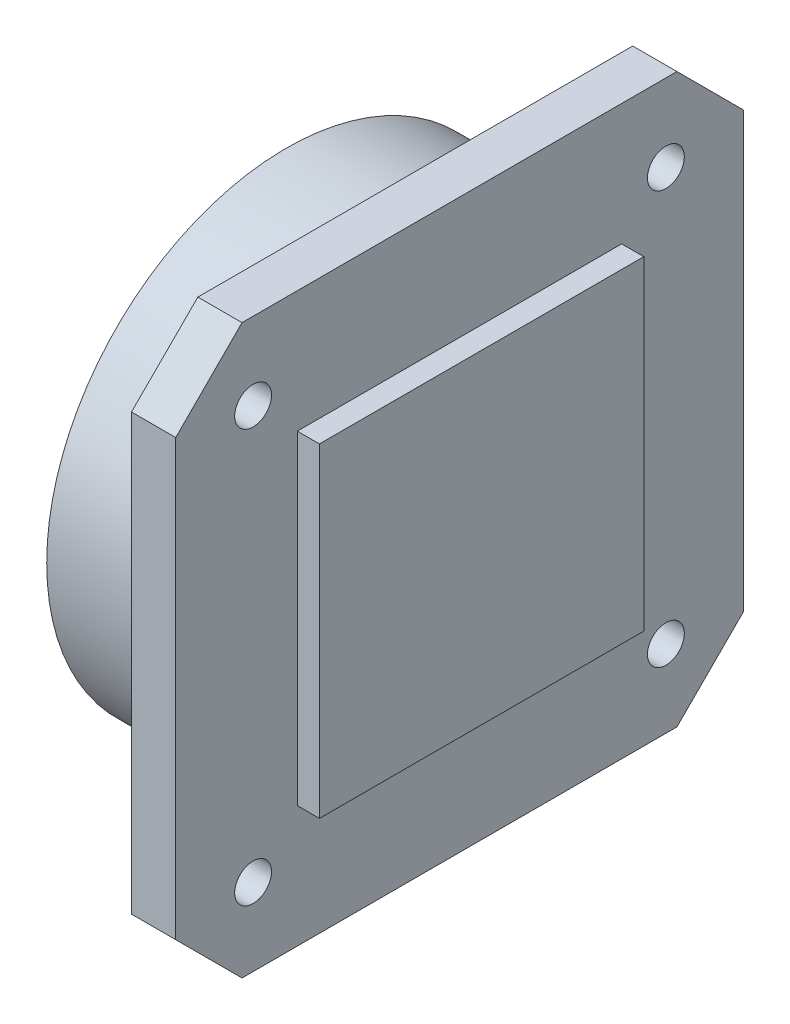
ISO-10303-21;
HEADER;
FILE_DESCRIPTION(('STEP AP214'),'2;1');
FILE_NAME('part.step','',(''),(''),'','','');
FILE_SCHEMA(('AUTOMOTIVE_DESIGN { 1 0 10303 214 1 1 1 1 }'));
ENDSEC;
DATA;
#1=APPLICATION_CONTEXT('core data for automotive mechanical design processes');
#2=APPLICATION_PROTOCOL_DEFINITION('international standard','automotive_design',2000,#1);
#3=PRODUCT_CONTEXT('',#1,'mechanical');
#4=PRODUCT('Part','Part','',(#3));
#5=PRODUCT_RELATED_PRODUCT_CATEGORY('part','',(#4));
#6=PRODUCT_DEFINITION_FORMATION('','',#4);
#7=PRODUCT_DEFINITION_CONTEXT('part definition',#1,'design');
#8=PRODUCT_DEFINITION('design','',#6,#7);
#9=PRODUCT_DEFINITION_SHAPE('','',#8);
#10=(LENGTH_UNIT() NAMED_UNIT(*) SI_UNIT(.MILLI.,.METRE.));
#11=(NAMED_UNIT(*) PLANE_ANGLE_UNIT() SI_UNIT($,.RADIAN.));
#12=(NAMED_UNIT(*) SI_UNIT($,.STERADIAN.) SOLID_ANGLE_UNIT());
#13=UNCERTAINTY_MEASURE_WITH_UNIT(LENGTH_MEASURE(1.E-05),#10,'distance_accuracy_value','');
#14=(GEOMETRIC_REPRESENTATION_CONTEXT(3) GLOBAL_UNCERTAINTY_ASSIGNED_CONTEXT((#13)) GLOBAL_UNIT_ASSIGNED_CONTEXT((#10,
#11,#12)) REPRESENTATION_CONTEXT('',''));
#15=CARTESIAN_POINT('',(0.,0.,0.));
#16=DIRECTION('',(0.,0.,1.));
#17=DIRECTION('',(1.,0.,0.));
#18=AXIS2_PLACEMENT_3D('',#15,#16,#17);
#19=CARTESIAN_POINT('',(0.,77.,0.));
#20=DIRECTION('',(-1.,0.,0.));
#21=DIRECTION('',(0.,0.,1.));
#22=AXIS2_PLACEMENT_3D('',#19,#20,#21);
#23=PLANE('',#22);
#24=CARTESIAN_POINT('',(0.,10.5,-66.5));
#25=DIRECTION('',(-1.,0.,0.));
#26=DIRECTION('',(0.,0.,1.));
#27=AXIS2_PLACEMENT_3D('',#24,#25,#26);
#28=CIRCLE('',#27,2.5);
#29=CARTESIAN_POINT('',(0.,10.5,-64.));
#30=VERTEX_POINT('',#29);
#31=EDGE_CURVE('E327',#30,#30,#28,.T.);
#32=ORIENTED_EDGE('',*,*,#31,.F.);
#33=EDGE_LOOP('',(#32));
#34=FACE_BOUND('',#33,.T.);
#35=CARTESIAN_POINT('',(0.,10.5,-10.5));
#36=DIRECTION('',(-1.,0.,0.));
#37=DIRECTION('',(0.,0.,1.));
#38=AXIS2_PLACEMENT_3D('',#35,#36,#37);
#39=CIRCLE('',#38,2.5);
#40=CARTESIAN_POINT('',(0.,10.5,-8.));
#41=VERTEX_POINT('',#40);
#42=EDGE_CURVE('E337',#41,#41,#39,.T.);
#43=ORIENTED_EDGE('',*,*,#42,.F.);
#44=EDGE_LOOP('',(#43));
#45=FACE_BOUND('',#44,.T.);
#46=CARTESIAN_POINT('',(0.,66.5,-66.5));
#47=DIRECTION('',(-1.,0.,0.));
#48=DIRECTION('',(0.,0.,1.));
#49=AXIS2_PLACEMENT_3D('',#46,#47,#48);
#50=CIRCLE('',#49,2.5);
#51=CARTESIAN_POINT('',(0.,66.5,-64.));
#52=VERTEX_POINT('',#51);
#53=EDGE_CURVE('E343',#52,#52,#50,.T.);
#54=ORIENTED_EDGE('',*,*,#53,.F.);
#55=EDGE_LOOP('',(#54));
#56=FACE_BOUND('',#55,.T.);
#57=CARTESIAN_POINT('',(0.,66.5,-10.5));
#58=DIRECTION('',(-1.,0.,0.));
#59=DIRECTION('',(0.,0.,1.));
#60=AXIS2_PLACEMENT_3D('',#57,#58,#59);
#61=CIRCLE('',#60,2.5);
#62=CARTESIAN_POINT('',(0.,66.5,-8.));
#63=VERTEX_POINT('',#62);
#64=EDGE_CURVE('E349',#63,#63,#61,.T.);
#65=ORIENTED_EDGE('',*,*,#64,.F.);
#66=EDGE_LOOP('',(#65));
#67=FACE_BOUND('',#66,.T.);
#68=DIRECTION('',(0.,-1.,0.));
#69=VECTOR('',#68,1.);
#70=CARTESIAN_POINT('',(0.,9.,0.));
#71=LINE('',#70,#69);
#72=CARTESIAN_POINT('',(0.,68.,0.));
#73=VERTEX_POINT('',#72);
#74=CARTESIAN_POINT('',(0.,9.,0.));
#75=VERTEX_POINT('',#74);
#76=EDGE_CURVE('E142',#73,#75,#71,.T.);
#77=ORIENTED_EDGE('',*,*,#76,.F.);
#78=DIRECTION('',(0.,-0.707106781186547,0.707106781186548));
#79=VECTOR('',#78,1.);
#80=CARTESIAN_POINT('',(0.,68.,0.));
#81=LINE('',#80,#79);
#82=CARTESIAN_POINT('',(0.,77.,-9.));
#83=VERTEX_POINT('',#82);
#84=EDGE_CURVE('E155',#83,#73,#81,.T.);
#85=ORIENTED_EDGE('',*,*,#84,.F.);
#86=DIRECTION('',(0.,0.,1.));
#87=VECTOR('',#86,1.);
#88=CARTESIAN_POINT('',(0.,77.,-9.));
#89=LINE('',#88,#87);
#90=CARTESIAN_POINT('',(0.,77.,-68.));
#91=VERTEX_POINT('',#90);
#92=EDGE_CURVE('E179',#91,#83,#89,.T.);
#93=ORIENTED_EDGE('',*,*,#92,.F.);
#94=DIRECTION('',(0.,0.707106781186548,0.707106781186548));
#95=VECTOR('',#94,1.);
#96=CARTESIAN_POINT('',(0.,77.,-68.));
#97=LINE('',#96,#95);
#98=CARTESIAN_POINT('',(0.,68.,-77.));
#99=VERTEX_POINT('',#98);
#100=EDGE_CURVE('E177',#99,#91,#97,.T.);
#101=ORIENTED_EDGE('',*,*,#100,.F.);
#102=DIRECTION('',(0.,1.,0.));
#103=VECTOR('',#102,1.);
#104=CARTESIAN_POINT('',(0.,9.,-77.));
#105=LINE('',#104,#103);
#106=CARTESIAN_POINT('',(0.,9.,-77.));
#107=VERTEX_POINT('',#106);
#108=EDGE_CURVE('E175',#107,#99,#105,.T.);
#109=ORIENTED_EDGE('',*,*,#108,.F.);
#110=DIRECTION('',(0.,0.707106781186548,-0.707106781186547));
#111=VECTOR('',#110,1.);
#112=CARTESIAN_POINT('',(0.,0.,-68.));
#113=LINE('',#112,#111);
#114=CARTESIAN_POINT('',(0.,0.,-68.));
#115=VERTEX_POINT('',#114);
#116=EDGE_CURVE('E173',#115,#107,#113,.T.);
#117=ORIENTED_EDGE('',*,*,#116,.F.);
#118=DIRECTION('',(0.,0.,-1.));
#119=VECTOR('',#118,1.);
#120=CARTESIAN_POINT('',(0.,0.,-9.));
#121=LINE('',#120,#119);
#122=CARTESIAN_POINT('',(0.,0.,-9.));
#123=VERTEX_POINT('',#122);
#124=EDGE_CURVE('E171',#123,#115,#121,.T.);
#125=ORIENTED_EDGE('',*,*,#124,.F.);
#126=DIRECTION('',(0.,-0.707106781186547,-0.707106781186547));
#127=VECTOR('',#126,1.);
#128=CARTESIAN_POINT('',(0.,9.,0.));
#129=LINE('',#128,#127);
#130=EDGE_CURVE('E145',#75,#123,#129,.T.);
#131=ORIENTED_EDGE('',*,*,#130,.F.);
#132=EDGE_LOOP('',(#77,#85,#93,#101,#109,#117,#125,#131));
#133=FACE_BOUND('',#132,.T.);
#134=CARTESIAN_POINT('',(0.,38.5,-38.5));
#135=DIRECTION('',(-1.,0.,0.));
#136=DIRECTION('',(0.,0.,1.));
#137=AXIS2_PLACEMENT_3D('',#134,#135,#136);
#138=CIRCLE('',#137,32.5);
#139=CARTESIAN_POINT('',(0.,38.5,-6.00000000000001));
#140=VERTEX_POINT('',#139);
#141=EDGE_CURVE('E358',#140,#140,#138,.T.);
#142=ORIENTED_EDGE('',*,*,#141,.F.);
#143=EDGE_LOOP('',(#142));
#144=FACE_BOUND('',#143,.T.);
#145=ADVANCED_FACE('F32',(#34,#45,#56,#67,#133,#144),#23,.T.);
#146=CARTESIAN_POINT('',(6.,77.,0.));
#147=DIRECTION('',(-1.,0.,0.));
#148=DIRECTION('',(0.,0.,1.));
#149=AXIS2_PLACEMENT_3D('',#146,#147,#148);
#150=PLANE('',#149);
#151=CARTESIAN_POINT('',(6.,10.5,-66.5));
#152=DIRECTION('',(1.,0.,0.));
#153=DIRECTION('',(0.,0.,-1.));
#154=AXIS2_PLACEMENT_3D('',#151,#152,#153);
#155=CIRCLE('',#154,2.5);
#156=CARTESIAN_POINT('',(6.,10.5,-69.));
#157=VERTEX_POINT('',#156);
#158=EDGE_CURVE('E323',#157,#157,#155,.T.);
#159=ORIENTED_EDGE('',*,*,#158,.F.);
#160=EDGE_LOOP('',(#159));
#161=FACE_BOUND('',#160,.T.);
#162=CARTESIAN_POINT('',(6.,10.5,-10.5));
#163=DIRECTION('',(1.,0.,0.));
#164=DIRECTION('',(0.,0.,-1.));
#165=AXIS2_PLACEMENT_3D('',#162,#163,#164);
#166=CIRCLE('',#165,2.5);
#167=CARTESIAN_POINT('',(6.,10.5,-13.));
#168=VERTEX_POINT('',#167);
#169=EDGE_CURVE('E334',#168,#168,#166,.T.);
#170=ORIENTED_EDGE('',*,*,#169,.F.);
#171=EDGE_LOOP('',(#170));
#172=FACE_BOUND('',#171,.T.);
#173=CARTESIAN_POINT('',(6.,66.5,-66.5));
#174=DIRECTION('',(1.,0.,0.));
#175=DIRECTION('',(0.,0.,-1.));
#176=AXIS2_PLACEMENT_3D('',#173,#174,#175);
#177=CIRCLE('',#176,2.5);
#178=CARTESIAN_POINT('',(6.,66.5,-69.));
#179=VERTEX_POINT('',#178);
#180=EDGE_CURVE('E340',#179,#179,#177,.T.);
#181=ORIENTED_EDGE('',*,*,#180,.F.);
#182=EDGE_LOOP('',(#181));
#183=FACE_BOUND('',#182,.T.);
#184=CARTESIAN_POINT('',(6.,66.5,-10.5));
#185=DIRECTION('',(1.,0.,0.));
#186=DIRECTION('',(0.,0.,-1.));
#187=AXIS2_PLACEMENT_3D('',#184,#185,#186);
#188=CIRCLE('',#187,2.5);
#189=CARTESIAN_POINT('',(6.,66.5,-13.));
#190=VERTEX_POINT('',#189);
#191=EDGE_CURVE('E346',#190,#190,#188,.T.);
#192=ORIENTED_EDGE('',*,*,#191,.F.);
#193=EDGE_LOOP('',(#192));
#194=FACE_BOUND('',#193,.T.);
#195=DIRECTION('',(0.,-1.,0.));
#196=VECTOR('',#195,1.);
#197=CARTESIAN_POINT('',(6.,9.,0.));
#198=LINE('',#197,#196);
#199=CARTESIAN_POINT('',(6.,68.,0.));
#200=VERTEX_POINT('',#199);
#201=CARTESIAN_POINT('',(6.,9.,0.));
#202=VERTEX_POINT('',#201);
#203=EDGE_CURVE('E151',#200,#202,#198,.T.);
#204=ORIENTED_EDGE('',*,*,#203,.T.);
#205=DIRECTION('',(0.,-0.707106781186547,-0.707106781186547));
#206=VECTOR('',#205,1.);
#207=CARTESIAN_POINT('',(6.,9.,0.));
#208=LINE('',#207,#206);
#209=CARTESIAN_POINT('',(6.,0.,-9.));
#210=VERTEX_POINT('',#209);
#211=EDGE_CURVE('E154',#202,#210,#208,.T.);
#212=ORIENTED_EDGE('',*,*,#211,.T.);
#213=DIRECTION('',(0.,0.,-1.));
#214=VECTOR('',#213,1.);
#215=CARTESIAN_POINT('',(6.,0.,-9.));
#216=LINE('',#215,#214);
#217=CARTESIAN_POINT('',(6.,0.,-68.));
#218=VERTEX_POINT('',#217);
#219=EDGE_CURVE('E157',#210,#218,#216,.T.);
#220=ORIENTED_EDGE('',*,*,#219,.T.);
#221=DIRECTION('',(0.,0.707106781186548,-0.707106781186547));
#222=VECTOR('',#221,1.);
#223=CARTESIAN_POINT('',(6.,0.,-68.));
#224=LINE('',#223,#222);
#225=CARTESIAN_POINT('',(6.,9.,-77.));
#226=VERTEX_POINT('',#225);
#227=EDGE_CURVE('E159',#218,#226,#224,.T.);
#228=ORIENTED_EDGE('',*,*,#227,.T.);
#229=DIRECTION('',(0.,1.,0.));
#230=VECTOR('',#229,1.);
#231=CARTESIAN_POINT('',(6.,9.,-77.));
#232=LINE('',#231,#230);
#233=CARTESIAN_POINT('',(6.,68.,-77.));
#234=VERTEX_POINT('',#233);
#235=EDGE_CURVE('E161',#226,#234,#232,.T.);
#236=ORIENTED_EDGE('',*,*,#235,.T.);
#237=DIRECTION('',(0.,0.707106781186548,0.707106781186548));
#238=VECTOR('',#237,1.);
#239=CARTESIAN_POINT('',(6.,77.,-68.));
#240=LINE('',#239,#238);
#241=CARTESIAN_POINT('',(6.,77.,-68.));
#242=VERTEX_POINT('',#241);
#243=EDGE_CURVE('E163',#234,#242,#240,.T.);
#244=ORIENTED_EDGE('',*,*,#243,.T.);
#245=DIRECTION('',(0.,0.,1.));
#246=VECTOR('',#245,1.);
#247=CARTESIAN_POINT('',(6.,77.,-9.));
#248=LINE('',#247,#246);
#249=CARTESIAN_POINT('',(6.,77.,-9.));
#250=VERTEX_POINT('',#249);
#251=EDGE_CURVE('E165',#242,#250,#248,.T.);
#252=ORIENTED_EDGE('',*,*,#251,.T.);
#253=DIRECTION('',(0.,-0.707106781186547,0.707106781186548));
#254=VECTOR('',#253,1.);
#255=CARTESIAN_POINT('',(6.,68.,0.));
#256=LINE('',#255,#254);
#257=EDGE_CURVE('E167',#250,#200,#256,.T.);
#258=ORIENTED_EDGE('',*,*,#257,.T.);
#259=EDGE_LOOP('',(#204,#212,#220,#228,#236,#244,#252,#258));
#260=FACE_BOUND('',#259,.T.);
#261=DIRECTION('',(0.,-1.,0.));
#262=VECTOR('',#261,1.);
#263=CARTESIAN_POINT('',(6.,60.5,-16.5));
#264=LINE('',#263,#262);
#265=CARTESIAN_POINT('',(6.,60.5,-16.5));
#266=VERTEX_POINT('',#265);
#267=CARTESIAN_POINT('',(6.,16.5,-16.5));
#268=VERTEX_POINT('',#267);
#269=EDGE_CURVE('E141',#266,#268,#264,.T.);
#270=ORIENTED_EDGE('',*,*,#269,.F.);
#271=DIRECTION('',(0.,0.,1.));
#272=VECTOR('',#271,1.);
#273=CARTESIAN_POINT('',(6.,60.5,-16.5));
#274=LINE('',#273,#272);
#275=CARTESIAN_POINT('',(6.,60.5,-60.5));
#276=VERTEX_POINT('',#275);
#277=EDGE_CURVE('E138',#276,#266,#274,.T.);
#278=ORIENTED_EDGE('',*,*,#277,.F.);
#279=DIRECTION('',(0.,1.,0.));
#280=VECTOR('',#279,1.);
#281=CARTESIAN_POINT('',(6.,60.5,-60.5));
#282=LINE('',#281,#280);
#283=CARTESIAN_POINT('',(6.,16.5,-60.5));
#284=VERTEX_POINT('',#283);
#285=EDGE_CURVE('E52',#284,#276,#282,.T.);
#286=ORIENTED_EDGE('',*,*,#285,.F.);
#287=DIRECTION('',(0.,0.,-1.));
#288=VECTOR('',#287,1.);
#289=CARTESIAN_POINT('',(6.,16.5,-16.5));
#290=LINE('',#289,#288);
#291=EDGE_CURVE('E47',#268,#284,#290,.T.);
#292=ORIENTED_EDGE('',*,*,#291,.F.);
#293=EDGE_LOOP('',(#270,#278,#286,#292));
#294=FACE_BOUND('',#293,.T.);
#295=ADVANCED_FACE('F222',(#161,#172,#183,#194,#260,#294),#150,.F.);
#296=CARTESIAN_POINT('',(6.,9.,0.));
#297=DIRECTION('',(0.,0.,-1.));
#298=DIRECTION('',(-1.,0.,0.));
#299=AXIS2_PLACEMENT_3D('',#296,#297,#298);
#300=PLANE('',#299);
#301=ORIENTED_EDGE('',*,*,#76,.T.);
#302=DIRECTION('',(-1.,0.,0.));
#303=VECTOR('',#302,1.);
#304=CARTESIAN_POINT('',(6.,9.,0.));
#305=LINE('',#304,#303);
#306=EDGE_CURVE('E11',#202,#75,#305,.T.);
#307=ORIENTED_EDGE('',*,*,#306,.F.);
#308=ORIENTED_EDGE('',*,*,#203,.F.);
#309=DIRECTION('',(-1.,0.,0.));
#310=VECTOR('',#309,1.);
#311=CARTESIAN_POINT('',(6.,68.,0.));
#312=LINE('',#311,#310);
#313=EDGE_CURVE('E168',#200,#73,#312,.T.);
#314=ORIENTED_EDGE('',*,*,#313,.T.);
#315=EDGE_LOOP('',(#301,#307,#308,#314));
#316=FACE_BOUND('',#315,.T.);
#317=ADVANCED_FACE('F34',(#316),#300,.F.);
#318=CARTESIAN_POINT('',(6.,9.,0.));
#319=DIRECTION('',(0.,0.707106781186548,-0.707106781186548));
#320=DIRECTION('',(0.,0.707106781186548,0.707106781186548));
#321=AXIS2_PLACEMENT_3D('',#318,#319,#320);
#322=PLANE('',#321);
#323=ORIENTED_EDGE('',*,*,#130,.T.);
#324=DIRECTION('',(-1.,0.,0.));
#325=VECTOR('',#324,1.);
#326=CARTESIAN_POINT('',(6.,0.,-9.));
#327=LINE('',#326,#325);
#328=EDGE_CURVE('E40',#210,#123,#327,.T.);
#329=ORIENTED_EDGE('',*,*,#328,.F.);
#330=ORIENTED_EDGE('',*,*,#211,.F.);
#331=ORIENTED_EDGE('',*,*,#306,.T.);
#332=EDGE_LOOP('',(#323,#329,#330,#331));
#333=FACE_BOUND('',#332,.T.);
#334=ADVANCED_FACE('F226',(#333),#322,.F.);
#335=CARTESIAN_POINT('',(6.,0.,-9.));
#336=DIRECTION('',(0.,1.,0.));
#337=DIRECTION('',(0.,0.,1.));
#338=AXIS2_PLACEMENT_3D('',#335,#336,#337);
#339=PLANE('',#338);
#340=ORIENTED_EDGE('',*,*,#124,.T.);
#341=DIRECTION('',(-1.,0.,0.));
#342=VECTOR('',#341,1.);
#343=CARTESIAN_POINT('',(6.,0.,-68.));
#344=LINE('',#343,#342);
#345=EDGE_CURVE('E196',#218,#115,#344,.T.);
#346=ORIENTED_EDGE('',*,*,#345,.F.);
#347=ORIENTED_EDGE('',*,*,#219,.F.);
#348=ORIENTED_EDGE('',*,*,#328,.T.);
#349=EDGE_LOOP('',(#340,#346,#347,#348));
#350=FACE_BOUND('',#349,.T.);
#351=ADVANCED_FACE('F203',(#350),#339,.F.);
#352=CARTESIAN_POINT('',(6.,0.,-68.));
#353=DIRECTION('',(0.,0.707106781186547,0.707106781186548));
#354=DIRECTION('',(0.,-0.707106781186548,0.707106781186547));
#355=AXIS2_PLACEMENT_3D('',#352,#353,#354);
#356=PLANE('',#355);
#357=ORIENTED_EDGE('',*,*,#116,.T.);
#358=DIRECTION('',(-1.,0.,0.));
#359=VECTOR('',#358,1.);
#360=CARTESIAN_POINT('',(6.,9.,-77.));
#361=LINE('',#360,#359);
#362=EDGE_CURVE('E193',#226,#107,#361,.T.);
#363=ORIENTED_EDGE('',*,*,#362,.F.);
#364=ORIENTED_EDGE('',*,*,#227,.F.);
#365=ORIENTED_EDGE('',*,*,#345,.T.);
#366=EDGE_LOOP('',(#357,#363,#364,#365));
#367=FACE_BOUND('',#366,.T.);
#368=ADVANCED_FACE('F214',(#367),#356,.F.);
#369=CARTESIAN_POINT('',(6.,9.,-77.));
#370=DIRECTION('',(0.,0.,1.));
#371=DIRECTION('',(1.,0.,0.));
#372=AXIS2_PLACEMENT_3D('',#369,#370,#371);
#373=PLANE('',#372);
#374=ORIENTED_EDGE('',*,*,#108,.T.);
#375=DIRECTION('',(-1.,0.,0.));
#376=VECTOR('',#375,1.);
#377=CARTESIAN_POINT('',(6.,68.,-77.));
#378=LINE('',#377,#376);
#379=EDGE_CURVE('E190',#234,#99,#378,.T.);
#380=ORIENTED_EDGE('',*,*,#379,.F.);
#381=ORIENTED_EDGE('',*,*,#235,.F.);
#382=ORIENTED_EDGE('',*,*,#362,.T.);
#383=EDGE_LOOP('',(#374,#380,#381,#382));
#384=FACE_BOUND('',#383,.T.);
#385=ADVANCED_FACE('F218',(#384),#373,.F.);
#386=CARTESIAN_POINT('',(6.,77.,-68.));
#387=DIRECTION('',(0.,-0.707106781186547,0.707106781186547));
#388=DIRECTION('',(0.,-0.707106781186548,-0.707106781186548));
#389=AXIS2_PLACEMENT_3D('',#386,#387,#388);
#390=PLANE('',#389);
#391=ORIENTED_EDGE('',*,*,#100,.T.);
#392=DIRECTION('',(-1.,0.,0.));
#393=VECTOR('',#392,1.);
#394=CARTESIAN_POINT('',(6.,77.,-68.));
#395=LINE('',#394,#393);
#396=EDGE_CURVE('E187',#242,#91,#395,.T.);
#397=ORIENTED_EDGE('',*,*,#396,.F.);
#398=ORIENTED_EDGE('',*,*,#243,.F.);
#399=ORIENTED_EDGE('',*,*,#379,.T.);
#400=EDGE_LOOP('',(#391,#397,#398,#399));
#401=FACE_BOUND('',#400,.T.);
#402=ADVANCED_FACE('F239',(#401),#390,.F.);
#403=CARTESIAN_POINT('',(6.,77.,-9.));
#404=DIRECTION('',(0.,-1.,0.));
#405=DIRECTION('',(0.,0.,-1.));
#406=AXIS2_PLACEMENT_3D('',#403,#404,#405);
#407=PLANE('',#406);
#408=ORIENTED_EDGE('',*,*,#92,.T.);
#409=DIRECTION('',(-1.,0.,0.));
#410=VECTOR('',#409,1.);
#411=CARTESIAN_POINT('',(6.,77.,-9.));
#412=LINE('',#411,#410);
#413=EDGE_CURVE('E184',#250,#83,#412,.T.);
#414=ORIENTED_EDGE('',*,*,#413,.F.);
#415=ORIENTED_EDGE('',*,*,#251,.F.);
#416=ORIENTED_EDGE('',*,*,#396,.T.);
#417=EDGE_LOOP('',(#408,#414,#415,#416));
#418=FACE_BOUND('',#417,.T.);
#419=ADVANCED_FACE('F237',(#418),#407,.F.);
#420=CARTESIAN_POINT('',(6.,68.,0.));
#421=DIRECTION('',(0.,-0.707106781186548,-0.707106781186547));
#422=DIRECTION('',(0.,0.707106781186547,-0.707106781186548));
#423=AXIS2_PLACEMENT_3D('',#420,#421,#422);
#424=PLANE('',#423);
#425=ORIENTED_EDGE('',*,*,#84,.T.);
#426=ORIENTED_EDGE('',*,*,#313,.F.);
#427=ORIENTED_EDGE('',*,*,#257,.F.);
#428=ORIENTED_EDGE('',*,*,#413,.T.);
#429=EDGE_LOOP('',(#425,#426,#427,#428));
#430=FACE_BOUND('',#429,.T.);
#431=ADVANCED_FACE('F232',(#430),#424,.F.);
#432=CARTESIAN_POINT('',(9.,60.5,-16.5));
#433=DIRECTION('',(0.,0.,-1.));
#434=DIRECTION('',(0.,1.,0.));
#435=AXIS2_PLACEMENT_3D('',#432,#433,#434);
#436=PLANE('',#435);
#437=ORIENTED_EDGE('',*,*,#269,.T.);
#438=DIRECTION('',(-1.,0.,0.));
#439=VECTOR('',#438,1.);
#440=CARTESIAN_POINT('',(9.,16.5,-16.5));
#441=LINE('',#440,#439);
#442=CARTESIAN_POINT('',(9.,16.5,-16.5));
#443=VERTEX_POINT('',#442);
#444=EDGE_CURVE('E122',#443,#268,#441,.T.);
#445=ORIENTED_EDGE('',*,*,#444,.F.);
#446=DIRECTION('',(0.,-1.,0.));
#447=VECTOR('',#446,1.);
#448=CARTESIAN_POINT('',(9.,60.5,-16.5));
#449=LINE('',#448,#447);
#450=CARTESIAN_POINT('',(9.,60.5,-16.5));
#451=VERTEX_POINT('',#450);
#452=EDGE_CURVE('E129',#451,#443,#449,.T.);
#453=ORIENTED_EDGE('',*,*,#452,.F.);
#454=DIRECTION('',(-1.,0.,0.));
#455=VECTOR('',#454,1.);
#456=CARTESIAN_POINT('',(9.,60.5,-16.5));
#457=LINE('',#456,#455);
#458=EDGE_CURVE('E366',#451,#266,#457,.T.);
#459=ORIENTED_EDGE('',*,*,#458,.T.);
#460=EDGE_LOOP('',(#437,#445,#453,#459));
#461=FACE_BOUND('',#460,.T.);
#462=ADVANCED_FACE('F140',(#461),#436,.F.);
#463=CARTESIAN_POINT('',(9.,16.5,-16.5));
#464=DIRECTION('',(0.,1.,0.));
#465=DIRECTION('',(0.,0.,1.));
#466=AXIS2_PLACEMENT_3D('',#463,#464,#465);
#467=PLANE('',#466);
#468=ORIENTED_EDGE('',*,*,#291,.T.);
#469=DIRECTION('',(-1.,0.,0.));
#470=VECTOR('',#469,1.);
#471=CARTESIAN_POINT('',(9.,16.5,-60.5));
#472=LINE('',#471,#470);
#473=CARTESIAN_POINT('',(9.,16.5,-60.5));
#474=VERTEX_POINT('',#473);
#475=EDGE_CURVE('E125',#474,#284,#472,.T.);
#476=ORIENTED_EDGE('',*,*,#475,.F.);
#477=DIRECTION('',(0.,0.,-1.));
#478=VECTOR('',#477,1.);
#479=CARTESIAN_POINT('',(9.,16.5,-16.5));
#480=LINE('',#479,#478);
#481=EDGE_CURVE('E118',#443,#474,#480,.T.);
#482=ORIENTED_EDGE('',*,*,#481,.F.);
#483=ORIENTED_EDGE('',*,*,#444,.T.);
#484=EDGE_LOOP('',(#468,#476,#482,#483));
#485=FACE_BOUND('',#484,.T.);
#486=ADVANCED_FACE('F120',(#485),#467,.F.);
#487=CARTESIAN_POINT('',(9.,60.5,-60.5));
#488=DIRECTION('',(0.,0.,1.));
#489=DIRECTION('',(0.,-1.,0.));
#490=AXIS2_PLACEMENT_3D('',#487,#488,#489);
#491=PLANE('',#490);
#492=ORIENTED_EDGE('',*,*,#285,.T.);
#493=DIRECTION('',(-1.,0.,0.));
#494=VECTOR('',#493,1.);
#495=CARTESIAN_POINT('',(9.,60.5,-60.5));
#496=LINE('',#495,#494);
#497=CARTESIAN_POINT('',(9.,60.5,-60.5));
#498=VERTEX_POINT('',#497);
#499=EDGE_CURVE('E147',#498,#276,#496,.T.);
#500=ORIENTED_EDGE('',*,*,#499,.F.);
#501=DIRECTION('',(0.,1.,0.));
#502=VECTOR('',#501,1.);
#503=CARTESIAN_POINT('',(9.,60.5,-60.5));
#504=LINE('',#503,#502);
#505=EDGE_CURVE('E128',#474,#498,#504,.T.);
#506=ORIENTED_EDGE('',*,*,#505,.F.);
#507=ORIENTED_EDGE('',*,*,#475,.T.);
#508=EDGE_LOOP('',(#492,#500,#506,#507));
#509=FACE_BOUND('',#508,.T.);
#510=ADVANCED_FACE('F267',(#509),#491,.F.);
#511=CARTESIAN_POINT('',(9.,60.5,-16.5));
#512=DIRECTION('',(0.,-1.,0.));
#513=DIRECTION('',(0.,0.,-1.));
#514=AXIS2_PLACEMENT_3D('',#511,#512,#513);
#515=PLANE('',#514);
#516=ORIENTED_EDGE('',*,*,#277,.T.);
#517=ORIENTED_EDGE('',*,*,#458,.F.);
#518=DIRECTION('',(0.,0.,1.));
#519=VECTOR('',#518,1.);
#520=CARTESIAN_POINT('',(9.,60.5,-16.5));
#521=LINE('',#520,#519);
#522=EDGE_CURVE('E134',#498,#451,#521,.T.);
#523=ORIENTED_EDGE('',*,*,#522,.F.);
#524=ORIENTED_EDGE('',*,*,#499,.T.);
#525=EDGE_LOOP('',(#516,#517,#523,#524));
#526=FACE_BOUND('',#525,.T.);
#527=ADVANCED_FACE('F272',(#526),#515,.F.);
#528=CARTESIAN_POINT('',(9.,16.5,-16.5));
#529=DIRECTION('',(1.,0.,0.));
#530=DIRECTION('',(0.,0.,-1.));
#531=AXIS2_PLACEMENT_3D('',#528,#529,#530);
#532=PLANE('',#531);
#533=ORIENTED_EDGE('',*,*,#452,.T.);
#534=ORIENTED_EDGE('',*,*,#481,.T.);
#535=ORIENTED_EDGE('',*,*,#505,.T.);
#536=ORIENTED_EDGE('',*,*,#522,.T.);
#537=EDGE_LOOP('',(#533,#534,#535,#536));
#538=FACE_BOUND('',#537,.T.);
#539=ADVANCED_FACE('F132',(#538),#532,.T.);
#540=CARTESIAN_POINT('',(-17.5,38.5,-38.5));
#541=DIRECTION('',(1.,0.,0.));
#542=DIRECTION('',(0.,0.,-1.));
#543=AXIS2_PLACEMENT_3D('',#540,#541,#542);
#544=CYLINDRICAL_SURFACE('',#543,32.5);
#545=CARTESIAN_POINT('',(-17.5,38.5,-38.5));
#546=DIRECTION('',(-1.,0.,0.));
#547=DIRECTION('',(0.,0.,1.));
#548=AXIS2_PLACEMENT_3D('',#545,#546,#547);
#549=CIRCLE('',#548,32.5);
#550=CARTESIAN_POINT('',(-17.5,38.5,-6.00000000000001));
#551=VERTEX_POINT('',#550);
#552=EDGE_CURVE('E359',#551,#551,#549,.T.);
#553=ORIENTED_EDGE('',*,*,#552,.F.);
#554=EDGE_LOOP('',(#553));
#555=FACE_BOUND('',#554,.T.);
#556=ORIENTED_EDGE('',*,*,#141,.T.);
#557=EDGE_LOOP('',(#556));
#558=FACE_BOUND('',#557,.T.);
#559=ADVANCED_FACE('F279',(#555,#558),#544,.T.);
#560=CARTESIAN_POINT('',(-17.5,38.5,-38.5));
#561=DIRECTION('',(-1.,0.,0.));
#562=DIRECTION('',(0.,0.,1.));
#563=AXIS2_PLACEMENT_3D('',#560,#561,#562);
#564=PLANE('',#563);
#565=CARTESIAN_POINT('',(-17.5,38.5,-38.5));
#566=DIRECTION('',(-1.,0.,0.));
#567=DIRECTION('',(0.,0.,1.));
#568=AXIS2_PLACEMENT_3D('',#565,#566,#567);
#569=CIRCLE('',#568,21.);
#570=CARTESIAN_POINT('',(-17.5,38.5,-17.5));
#571=VERTEX_POINT('',#570);
#572=EDGE_CURVE('E355',#571,#571,#569,.T.);
#573=ORIENTED_EDGE('',*,*,#572,.F.);
#574=EDGE_LOOP('',(#573));
#575=FACE_BOUND('',#574,.T.);
#576=ORIENTED_EDGE('',*,*,#552,.T.);
#577=EDGE_LOOP('',(#576));
#578=FACE_BOUND('',#577,.T.);
#579=ADVANCED_FACE('F282',(#575,#578),#564,.T.);
#580=CARTESIAN_POINT('',(-5.5,38.5,-38.5));
#581=DIRECTION('',(-1.,0.,0.));
#582=DIRECTION('',(0.,0.,1.));
#583=AXIS2_PLACEMENT_3D('',#580,#581,#582);
#584=CONICAL_SURFACE('',#583,18.,0.244978663126864);
#585=ORIENTED_EDGE('',*,*,#572,.T.);
#586=EDGE_LOOP('',(#585));
#587=FACE_BOUND('',#586,.T.);
#588=CARTESIAN_POINT('',(-5.5,38.5,-38.5));
#589=DIRECTION('',(1.,0.,0.));
#590=DIRECTION('',(0.,0.,-1.));
#591=AXIS2_PLACEMENT_3D('',#588,#589,#590);
#592=CIRCLE('',#591,18.);
#593=CARTESIAN_POINT('',(-5.5,38.5,-56.5));
#594=VERTEX_POINT('',#593);
#595=EDGE_CURVE('E352',#594,#594,#592,.T.);
#596=ORIENTED_EDGE('',*,*,#595,.T.);
#597=EDGE_LOOP('',(#596));
#598=FACE_BOUND('',#597,.T.);
#599=ADVANCED_FACE('F286',(#587,#598),#584,.F.);
#600=CARTESIAN_POINT('',(-5.5,38.5,-38.5));
#601=DIRECTION('',(-1.,0.,0.));
#602=DIRECTION('',(0.,0.,1.));
#603=AXIS2_PLACEMENT_3D('',#600,#601,#602);
#604=PLANE('',#603);
#605=CARTESIAN_POINT('',(-5.5,38.5,-38.5));
#606=DIRECTION('',(-1.,0.,0.));
#607=DIRECTION('',(0.,0.,1.));
#608=AXIS2_PLACEMENT_3D('',#605,#606,#607);
#609=CIRCLE('',#608,12.5);
#610=CARTESIAN_POINT('',(-5.5,38.5,-26.));
#611=VERTEX_POINT('',#610);
#612=EDGE_CURVE('E324',#611,#611,#609,.T.);
#613=ORIENTED_EDGE('',*,*,#612,.F.);
#614=EDGE_LOOP('',(#613));
#615=FACE_BOUND('',#614,.T.);
#616=ORIENTED_EDGE('',*,*,#595,.F.);
#617=EDGE_LOOP('',(#616));
#618=FACE_BOUND('',#617,.T.);
#619=ADVANCED_FACE('F288',(#615,#618),#604,.T.);
#620=CARTESIAN_POINT('',(-17.5,66.5,-10.5));
#621=DIRECTION('',(1.,0.,0.));
#622=DIRECTION('',(0.,0.,-1.));
#623=AXIS2_PLACEMENT_3D('',#620,#621,#622);
#624=CYLINDRICAL_SURFACE('',#623,2.5);
#625=ORIENTED_EDGE('',*,*,#64,.T.);
#626=EDGE_LOOP('',(#625));
#627=FACE_BOUND('',#626,.T.);
#628=ORIENTED_EDGE('',*,*,#191,.T.);
#629=EDGE_LOOP('',(#628));
#630=FACE_BOUND('',#629,.T.);
#631=ADVANCED_FACE('F291',(#627,#630),#624,.F.);
#632=CARTESIAN_POINT('',(-17.5,66.5,-66.5));
#633=DIRECTION('',(1.,0.,0.));
#634=DIRECTION('',(0.,0.,-1.));
#635=AXIS2_PLACEMENT_3D('',#632,#633,#634);
#636=CYLINDRICAL_SURFACE('',#635,2.5);
#637=ORIENTED_EDGE('',*,*,#53,.T.);
#638=EDGE_LOOP('',(#637));
#639=FACE_BOUND('',#638,.T.);
#640=ORIENTED_EDGE('',*,*,#180,.T.);
#641=EDGE_LOOP('',(#640));
#642=FACE_BOUND('',#641,.T.);
#643=ADVANCED_FACE('F298',(#639,#642),#636,.F.);
#644=CARTESIAN_POINT('',(-17.5,10.5,-10.5));
#645=DIRECTION('',(1.,0.,0.));
#646=DIRECTION('',(0.,0.,-1.));
#647=AXIS2_PLACEMENT_3D('',#644,#645,#646);
#648=CYLINDRICAL_SURFACE('',#647,2.5);
#649=ORIENTED_EDGE('',*,*,#42,.T.);
#650=EDGE_LOOP('',(#649));
#651=FACE_BOUND('',#650,.T.);
#652=ORIENTED_EDGE('',*,*,#169,.T.);
#653=EDGE_LOOP('',(#652));
#654=FACE_BOUND('',#653,.T.);
#655=ADVANCED_FACE('F302',(#651,#654),#648,.F.);
#656=CARTESIAN_POINT('',(-17.5,10.5,-66.5));
#657=DIRECTION('',(1.,0.,0.));
#658=DIRECTION('',(0.,0.,-1.));
#659=AXIS2_PLACEMENT_3D('',#656,#657,#658);
#660=CYLINDRICAL_SURFACE('',#659,2.5);
#661=ORIENTED_EDGE('',*,*,#31,.T.);
#662=EDGE_LOOP('',(#661));
#663=FACE_BOUND('',#662,.T.);
#664=ORIENTED_EDGE('',*,*,#158,.T.);
#665=EDGE_LOOP('',(#664));
#666=FACE_BOUND('',#665,.T.);
#667=ADVANCED_FACE('F306',(#663,#666),#660,.F.);
#668=CARTESIAN_POINT('',(-1.5,38.5,-38.5));
#669=DIRECTION('',(-1.,0.,0.));
#670=DIRECTION('',(0.,0.,1.));
#671=AXIS2_PLACEMENT_3D('',#668,#669,#670);
#672=CYLINDRICAL_SURFACE('',#671,12.5);
#673=CARTESIAN_POINT('',(-1.5,38.5,-38.5));
#674=DIRECTION('',(-1.,0.,0.));
#675=DIRECTION('',(0.,0.,1.));
#676=AXIS2_PLACEMENT_3D('',#673,#674,#675);
#677=CIRCLE('',#676,12.5);
#678=CARTESIAN_POINT('',(-1.5,38.5,-26.));
#679=VERTEX_POINT('',#678);
#680=EDGE_CURVE('E322',#679,#679,#677,.T.);
#681=ORIENTED_EDGE('',*,*,#680,.F.);
#682=EDGE_LOOP('',(#681));
#683=FACE_BOUND('',#682,.T.);
#684=ORIENTED_EDGE('',*,*,#612,.T.);
#685=EDGE_LOOP('',(#684));
#686=FACE_BOUND('',#685,.T.);
#687=ADVANCED_FACE('F310',(#683,#686),#672,.F.);
#688=CARTESIAN_POINT('',(-1.5,38.5,-38.5));
#689=DIRECTION('',(-1.,0.,0.));
#690=DIRECTION('',(0.,0.,1.));
#691=AXIS2_PLACEMENT_3D('',#688,#689,#690);
#692=PLANE('',#691);
#693=ORIENTED_EDGE('',*,*,#680,.T.);
#694=EDGE_LOOP('',(#693));
#695=FACE_BOUND('',#694,.T.);
#696=ADVANCED_FACE('F314',(#695),#692,.T.);
#697=CLOSED_SHELL('',(#145,#295,#317,#334,#351,#368,#385,#402,#419,#431,#462,#486,#510,#527,
#539,#559,#579,#599,#619,#631,#643,#655,#667,#687,#696));
#698=MANIFOLD_SOLID_BREP('B2',#697);
#699=ADVANCED_BREP_SHAPE_REPRESENTATION('',(#18,#698),#14);
#700=SHAPE_DEFINITION_REPRESENTATION(#9,#699);
ENDSEC;
END-ISO-10303-21;
